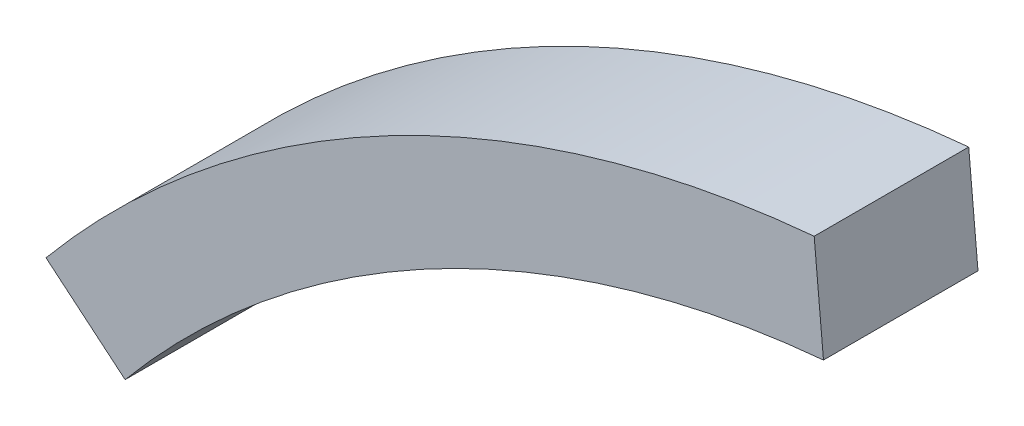
ISO-10303-21;
HEADER;
FILE_DESCRIPTION(('STEP AP214'),'2;1');
FILE_NAME('part.step','',(''),(''),'','','');
FILE_SCHEMA(('AUTOMOTIVE_DESIGN { 1 0 10303 214 1 1 1 1 }'));
ENDSEC;
DATA;
#1=APPLICATION_CONTEXT('core data for automotive mechanical design processes');
#2=APPLICATION_PROTOCOL_DEFINITION('international standard','automotive_design',2000,#1);
#3=PRODUCT_CONTEXT('',#1,'mechanical');
#4=PRODUCT('Part','Part','',(#3));
#5=PRODUCT_RELATED_PRODUCT_CATEGORY('part','',(#4));
#6=PRODUCT_DEFINITION_FORMATION('','',#4);
#7=PRODUCT_DEFINITION_CONTEXT('part definition',#1,'design');
#8=PRODUCT_DEFINITION('design','',#6,#7);
#9=PRODUCT_DEFINITION_SHAPE('','',#8);
#10=(LENGTH_UNIT() NAMED_UNIT(*) SI_UNIT(.MILLI.,.METRE.));
#11=(NAMED_UNIT(*) PLANE_ANGLE_UNIT() SI_UNIT($,.RADIAN.));
#12=(NAMED_UNIT(*) SI_UNIT($,.STERADIAN.) SOLID_ANGLE_UNIT());
#13=UNCERTAINTY_MEASURE_WITH_UNIT(LENGTH_MEASURE(1.E-05),#10,'distance_accuracy_value','');
#14=(GEOMETRIC_REPRESENTATION_CONTEXT(3) GLOBAL_UNCERTAINTY_ASSIGNED_CONTEXT((#13)) GLOBAL_UNIT_ASSIGNED_CONTEXT((#10,
#11,#12)) REPRESENTATION_CONTEXT('',''));
#15=CARTESIAN_POINT('',(0.,0.,0.));
#16=DIRECTION('',(0.,0.,1.));
#17=DIRECTION('',(1.,0.,0.));
#18=AXIS2_PLACEMENT_3D('',#15,#16,#17);
#19=CARTESIAN_POINT('',(0.,0.,3.));
#20=DIRECTION('',(0.,0.,-1.));
#21=DIRECTION('',(-1.,0.,0.));
#22=AXIS2_PLACEMENT_3D('',#19,#20,#21);
#23=CYLINDRICAL_SURFACE('',#22,20.);
#24=CARTESIAN_POINT('',(0.,0.,0.));
#25=DIRECTION('',(0.,0.,-1.));
#26=DIRECTION('',(1.,0.,0.));
#27=AXIS2_PLACEMENT_3D('',#24,#25,#26);
#28=CIRCLE('',#27,20.);
#29=CARTESIAN_POINT('',(-15.3584576206591,12.8108461669953,0.));
#30=VERTEX_POINT('',#29);
#31=CARTESIAN_POINT('',(-1.80143333471418,19.9187057295543,0.));
#32=VERTEX_POINT('',#31);
#33=EDGE_CURVE('E95',#30,#32,#28,.T.);
#34=ORIENTED_EDGE('',*,*,#33,.T.);
#35=DIRECTION('',(0.,0.,-1.));
#36=VECTOR('',#35,1.);
#37=CARTESIAN_POINT('',(-1.80143333471418,19.9187057295543,3.));
#38=LINE('',#37,#36);
#39=CARTESIAN_POINT('',(-1.80143333471418,19.9187057295543,3.));
#40=VERTEX_POINT('',#39);
#41=EDGE_CURVE('E11',#40,#32,#38,.T.);
#42=ORIENTED_EDGE('',*,*,#41,.F.);
#43=CARTESIAN_POINT('',(0.,0.,3.));
#44=DIRECTION('',(0.,0.,-1.));
#45=DIRECTION('',(1.,0.,0.));
#46=AXIS2_PLACEMENT_3D('',#43,#44,#45);
#47=CIRCLE('',#46,20.);
#48=CARTESIAN_POINT('',(-15.3584576206591,12.8108461669953,3.));
#49=VERTEX_POINT('',#48);
#50=EDGE_CURVE('E83',#49,#40,#47,.T.);
#51=ORIENTED_EDGE('',*,*,#50,.F.);
#52=DIRECTION('',(0.,0.,-1.));
#53=VECTOR('',#52,1.);
#54=CARTESIAN_POINT('',(-15.3584576206591,12.8108461669953,3.));
#55=LINE('',#54,#53);
#56=EDGE_CURVE('E91',#49,#30,#55,.T.);
#57=ORIENTED_EDGE('',*,*,#56,.T.);
#58=EDGE_LOOP('',(#34,#42,#51,#57));
#59=FACE_BOUND('',#58,.T.);
#60=ADVANCED_FACE('F32',(#59),#23,.F.);
#61=CARTESIAN_POINT('',(-1.80143333471418,19.9187057295543,3.));
#62=DIRECTION('',(-0.995935286477717,-0.0900716667357088,0.));
#63=DIRECTION('',(0.0900716667357088,-0.995935286477717,0.));
#64=AXIS2_PLACEMENT_3D('',#61,#62,#63);
#65=PLANE('',#64);
#66=DIRECTION('',(-0.0900716667357088,0.995935286477717,0.));
#67=VECTOR('',#66,1.);
#68=CARTESIAN_POINT('',(-1.80143333471418,19.9187057295543,0.));
#69=LINE('',#68,#67);
#70=CARTESIAN_POINT('',(-1.98157666818559,21.9105763025098,0.));
#71=VERTEX_POINT('',#70);
#72=EDGE_CURVE('E87',#32,#71,#69,.T.);
#73=ORIENTED_EDGE('',*,*,#72,.T.);
#74=DIRECTION('',(0.,0.,-1.));
#75=VECTOR('',#74,1.);
#76=CARTESIAN_POINT('',(-1.98157666818559,21.9105763025098,3.));
#77=LINE('',#76,#75);
#78=CARTESIAN_POINT('',(-1.98157666818559,21.9105763025098,3.));
#79=VERTEX_POINT('',#78);
#80=EDGE_CURVE('E40',#79,#71,#77,.T.);
#81=ORIENTED_EDGE('',*,*,#80,.F.);
#82=DIRECTION('',(-0.0900716667357088,0.995935286477717,0.));
#83=VECTOR('',#82,1.);
#84=CARTESIAN_POINT('',(-1.80143333471418,19.9187057295543,3.));
#85=LINE('',#84,#83);
#86=EDGE_CURVE('E78',#40,#79,#85,.T.);
#87=ORIENTED_EDGE('',*,*,#86,.F.);
#88=ORIENTED_EDGE('',*,*,#41,.T.);
#89=EDGE_LOOP('',(#73,#81,#87,#88));
#90=FACE_BOUND('',#89,.T.);
#91=ADVANCED_FACE('F86',(#90),#65,.F.);
#92=CARTESIAN_POINT('',(0.,0.,3.));
#93=DIRECTION('',(0.,0.,-1.));
#94=DIRECTION('',(-1.,0.,0.));
#95=AXIS2_PLACEMENT_3D('',#92,#93,#94);
#96=CYLINDRICAL_SURFACE('',#95,22.);
#97=CARTESIAN_POINT('',(0.,0.,0.));
#98=DIRECTION('',(0.,0.,1.));
#99=DIRECTION('',(1.,0.,0.));
#100=AXIS2_PLACEMENT_3D('',#97,#98,#99);
#101=CIRCLE('',#100,22.);
#102=CARTESIAN_POINT('',(-16.894303382725,14.0919307836948,0.));
#103=VERTEX_POINT('',#102);
#104=EDGE_CURVE('E65',#71,#103,#101,.T.);
#105=ORIENTED_EDGE('',*,*,#104,.T.);
#106=DIRECTION('',(0.,0.,-1.));
#107=VECTOR('',#106,1.);
#108=CARTESIAN_POINT('',(-16.894303382725,14.0919307836948,3.));
#109=LINE('',#108,#107);
#110=CARTESIAN_POINT('',(-16.894303382725,14.0919307836948,3.));
#111=VERTEX_POINT('',#110);
#112=EDGE_CURVE('E88',#111,#103,#109,.T.);
#113=ORIENTED_EDGE('',*,*,#112,.F.);
#114=CARTESIAN_POINT('',(0.,0.,3.));
#115=DIRECTION('',(0.,0.,1.));
#116=DIRECTION('',(1.,0.,0.));
#117=AXIS2_PLACEMENT_3D('',#114,#115,#116);
#118=CIRCLE('',#117,22.);
#119=EDGE_CURVE('E81',#79,#111,#118,.T.);
#120=ORIENTED_EDGE('',*,*,#119,.F.);
#121=ORIENTED_EDGE('',*,*,#80,.T.);
#122=EDGE_LOOP('',(#105,#113,#120,#121));
#123=FACE_BOUND('',#122,.T.);
#124=ADVANCED_FACE('F89',(#123),#96,.T.);
#125=CARTESIAN_POINT('',(-15.3584576206591,12.8108461669953,3.));
#126=DIRECTION('',(0.640542308349764,0.767922881032956,0.));
#127=DIRECTION('',(-0.767922881032956,0.640542308349764,0.));
#128=AXIS2_PLACEMENT_3D('',#125,#126,#127);
#129=PLANE('',#128);
#130=DIRECTION('',(0.767922881032956,-0.640542308349764,0.));
#131=VECTOR('',#130,1.);
#132=CARTESIAN_POINT('',(-15.3584576206591,12.8108461669953,0.));
#133=LINE('',#132,#131);
#134=EDGE_CURVE('E71',#103,#30,#133,.T.);
#135=ORIENTED_EDGE('',*,*,#134,.T.);
#136=ORIENTED_EDGE('',*,*,#56,.F.);
#137=DIRECTION('',(0.767922881032956,-0.640542308349764,0.));
#138=VECTOR('',#137,1.);
#139=CARTESIAN_POINT('',(-15.3584576206591,12.8108461669953,3.));
#140=LINE('',#139,#138);
#141=EDGE_CURVE('E48',#111,#49,#140,.T.);
#142=ORIENTED_EDGE('',*,*,#141,.F.);
#143=ORIENTED_EDGE('',*,*,#112,.T.);
#144=EDGE_LOOP('',(#135,#136,#142,#143));
#145=FACE_BOUND('',#144,.T.);
#146=ADVANCED_FACE('F102',(#145),#129,.F.);
#147=CARTESIAN_POINT('',(0.,0.,3.));
#148=DIRECTION('',(0.,0.,1.));
#149=DIRECTION('',(1.,0.,0.));
#150=AXIS2_PLACEMENT_3D('',#147,#148,#149);
#151=PLANE('',#150);
#152=ORIENTED_EDGE('',*,*,#50,.T.);
#153=ORIENTED_EDGE('',*,*,#86,.T.);
#154=ORIENTED_EDGE('',*,*,#119,.T.);
#155=ORIENTED_EDGE('',*,*,#141,.T.);
#156=EDGE_LOOP('',(#152,#153,#154,#155));
#157=FACE_BOUND('',#156,.T.);
#158=ADVANCED_FACE('F79',(#157),#151,.T.);
#159=CARTESIAN_POINT('',(0.,0.,0.));
#160=DIRECTION('',(0.,0.,1.));
#161=DIRECTION('',(1.,0.,0.));
#162=AXIS2_PLACEMENT_3D('',#159,#160,#161);
#163=PLANE('',#162);
#164=ORIENTED_EDGE('',*,*,#33,.F.);
#165=ORIENTED_EDGE('',*,*,#134,.F.);
#166=ORIENTED_EDGE('',*,*,#104,.F.);
#167=ORIENTED_EDGE('',*,*,#72,.F.);
#168=EDGE_LOOP('',(#164,#165,#166,#167));
#169=FACE_BOUND('',#168,.T.);
#170=ADVANCED_FACE('F105',(#169),#163,.F.);
#171=CLOSED_SHELL('',(#60,#91,#124,#146,#158,#170));
#172=MANIFOLD_SOLID_BREP('B2',#171);
#173=ADVANCED_BREP_SHAPE_REPRESENTATION('',(#18,#172),#14);
#174=SHAPE_DEFINITION_REPRESENTATION(#9,#173);
ENDSEC;
END-ISO-10303-21;
